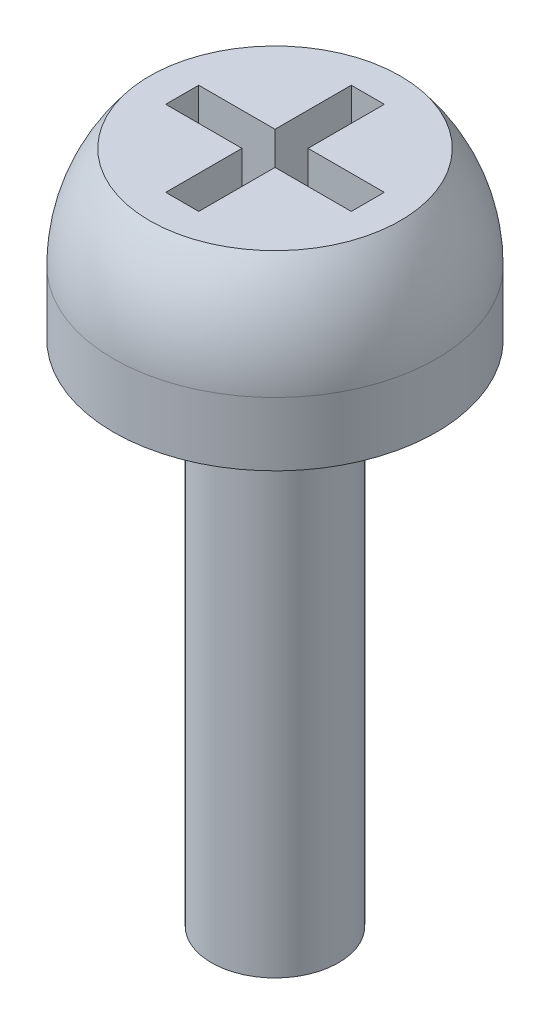
ISO-10303-21;
HEADER;
FILE_DESCRIPTION(('STEP AP214'),'2;1');
FILE_NAME('part.step','',(''),(''),'','','');
FILE_SCHEMA(('AUTOMOTIVE_DESIGN { 1 0 10303 214 1 1 1 1 }'));
ENDSEC;
DATA;
#1=APPLICATION_CONTEXT('core data for automotive mechanical design processes');
#2=APPLICATION_PROTOCOL_DEFINITION('international standard','automotive_design',2000,#1);
#3=PRODUCT_CONTEXT('',#1,'mechanical');
#4=PRODUCT('Part','Part','',(#3));
#5=PRODUCT_RELATED_PRODUCT_CATEGORY('part','',(#4));
#6=PRODUCT_DEFINITION_FORMATION('','',#4);
#7=PRODUCT_DEFINITION_CONTEXT('part definition',#1,'design');
#8=PRODUCT_DEFINITION('design','',#6,#7);
#9=PRODUCT_DEFINITION_SHAPE('','',#8);
#10=(LENGTH_UNIT() NAMED_UNIT(*) SI_UNIT(.MILLI.,.METRE.));
#11=(NAMED_UNIT(*) PLANE_ANGLE_UNIT() SI_UNIT($,.RADIAN.));
#12=(NAMED_UNIT(*) SI_UNIT($,.STERADIAN.) SOLID_ANGLE_UNIT());
#13=UNCERTAINTY_MEASURE_WITH_UNIT(LENGTH_MEASURE(1.E-05),#10,'distance_accuracy_value','');
#14=(GEOMETRIC_REPRESENTATION_CONTEXT(3) GLOBAL_UNCERTAINTY_ASSIGNED_CONTEXT((#13)) GLOBAL_UNIT_ASSIGNED_CONTEXT((#10,
#11,#12)) REPRESENTATION_CONTEXT('',''));
#15=CARTESIAN_POINT('',(0.,0.,0.));
#16=DIRECTION('',(0.,0.,1.));
#17=DIRECTION('',(1.,0.,0.));
#18=AXIS2_PLACEMENT_3D('',#15,#16,#17);
#19=CARTESIAN_POINT('',(0.,1.3,0.));
#20=DIRECTION('',(0.,-1.,0.));
#21=DIRECTION('',(0.,0.,-1.));
#22=AXIS2_PLACEMENT_3D('',#19,#20,#21);
#23=PLANE('',#22);
#24=CARTESIAN_POINT('',(0.,1.3,0.));
#25=DIRECTION('',(0.,-1.,0.));
#26=DIRECTION('',(0.,0.,-1.));
#27=AXIS2_PLACEMENT_3D('',#24,#25,#26);
#28=CIRCLE('',#27,0.986356933366416);
#29=CARTESIAN_POINT('',(0.,1.3,-0.986356933366416));
#30=VERTEX_POINT('',#29);
#31=EDGE_CURVE('E40',#30,#30,#28,.T.);
#32=ORIENTED_EDGE('',*,*,#31,.F.);
#33=EDGE_LOOP('',(#32));
#34=FACE_BOUND('',#33,.T.);
#35=DIRECTION('',(0.,0.,1.));
#36=VECTOR('',#35,1.);
#37=CARTESIAN_POINT('',(0.13,1.3,-0.13));
#38=LINE('',#37,#36);
#39=CARTESIAN_POINT('',(0.13,1.3,-0.73));
#40=VERTEX_POINT('',#39);
#41=CARTESIAN_POINT('',(0.13,1.3,-0.13));
#42=VERTEX_POINT('',#41);
#43=EDGE_CURVE('E53',#40,#42,#38,.T.);
#44=ORIENTED_EDGE('',*,*,#43,.T.);
#45=DIRECTION('',(1.,0.,0.));
#46=VECTOR('',#45,1.);
#47=CARTESIAN_POINT('',(0.13,1.3,-0.13));
#48=LINE('',#47,#46);
#49=CARTESIAN_POINT('',(0.73,1.3,-0.13));
#50=VERTEX_POINT('',#49);
#51=EDGE_CURVE('E161',#42,#50,#48,.T.);
#52=ORIENTED_EDGE('',*,*,#51,.T.);
#53=DIRECTION('',(0.,0.,1.));
#54=VECTOR('',#53,1.);
#55=CARTESIAN_POINT('',(0.73,1.3,-0.13));
#56=LINE('',#55,#54);
#57=CARTESIAN_POINT('',(0.73,1.3,0.13));
#58=VERTEX_POINT('',#57);
#59=EDGE_CURVE('E165',#50,#58,#56,.T.);
#60=ORIENTED_EDGE('',*,*,#59,.T.);
#61=DIRECTION('',(-1.,0.,0.));
#62=VECTOR('',#61,1.);
#63=CARTESIAN_POINT('',(0.13,1.3,0.13));
#64=LINE('',#63,#62);
#65=CARTESIAN_POINT('',(0.13,1.3,0.13));
#66=VERTEX_POINT('',#65);
#67=EDGE_CURVE('E168',#58,#66,#64,.T.);
#68=ORIENTED_EDGE('',*,*,#67,.T.);
#69=DIRECTION('',(0.,0.,1.));
#70=VECTOR('',#69,1.);
#71=CARTESIAN_POINT('',(0.13,1.3,0.73));
#72=LINE('',#71,#70);
#73=CARTESIAN_POINT('',(0.13,1.3,0.73));
#74=VERTEX_POINT('',#73);
#75=EDGE_CURVE('E171',#66,#74,#72,.T.);
#76=ORIENTED_EDGE('',*,*,#75,.T.);
#77=DIRECTION('',(-1.,0.,0.));
#78=VECTOR('',#77,1.);
#79=CARTESIAN_POINT('',(-0.13,1.3,0.73));
#80=LINE('',#79,#78);
#81=CARTESIAN_POINT('',(-0.13,1.3,0.73));
#82=VERTEX_POINT('',#81);
#83=EDGE_CURVE('E174',#74,#82,#80,.T.);
#84=ORIENTED_EDGE('',*,*,#83,.T.);
#85=DIRECTION('',(0.,0.,-1.));
#86=VECTOR('',#85,1.);
#87=CARTESIAN_POINT('',(-0.13,1.3,0.73));
#88=LINE('',#87,#86);
#89=CARTESIAN_POINT('',(-0.13,1.3,0.13));
#90=VERTEX_POINT('',#89);
#91=EDGE_CURVE('E177',#82,#90,#88,.T.);
#92=ORIENTED_EDGE('',*,*,#91,.T.);
#93=DIRECTION('',(-1.,0.,0.));
#94=VECTOR('',#93,1.);
#95=CARTESIAN_POINT('',(-0.73,1.3,0.13));
#96=LINE('',#95,#94);
#97=CARTESIAN_POINT('',(-0.73,1.3,0.13));
#98=VERTEX_POINT('',#97);
#99=EDGE_CURVE('E180',#90,#98,#96,.T.);
#100=ORIENTED_EDGE('',*,*,#99,.T.);
#101=DIRECTION('',(0.,0.,-1.));
#102=VECTOR('',#101,1.);
#103=CARTESIAN_POINT('',(-0.73,1.3,-0.13));
#104=LINE('',#103,#102);
#105=CARTESIAN_POINT('',(-0.73,1.3,-0.13));
#106=VERTEX_POINT('',#105);
#107=EDGE_CURVE('E183',#98,#106,#104,.T.);
#108=ORIENTED_EDGE('',*,*,#107,.T.);
#109=DIRECTION('',(1.,0.,0.));
#110=VECTOR('',#109,1.);
#111=CARTESIAN_POINT('',(-0.73,1.3,-0.13));
#112=LINE('',#111,#110);
#113=CARTESIAN_POINT('',(-0.13,1.3,-0.13));
#114=VERTEX_POINT('',#113);
#115=EDGE_CURVE('E186',#106,#114,#112,.T.);
#116=ORIENTED_EDGE('',*,*,#115,.T.);
#117=DIRECTION('',(0.,0.,-1.));
#118=VECTOR('',#117,1.);
#119=CARTESIAN_POINT('',(-0.13,1.3,-0.13));
#120=LINE('',#119,#118);
#121=CARTESIAN_POINT('',(-0.13,1.3,-0.73));
#122=VERTEX_POINT('',#121);
#123=EDGE_CURVE('E151',#114,#122,#120,.T.);
#124=ORIENTED_EDGE('',*,*,#123,.T.);
#125=DIRECTION('',(1.,0.,0.));
#126=VECTOR('',#125,1.);
#127=CARTESIAN_POINT('',(-0.13,1.3,-0.73));
#128=LINE('',#127,#126);
#129=EDGE_CURVE('E189',#122,#40,#128,.T.);
#130=ORIENTED_EDGE('',*,*,#129,.T.);
#131=EDGE_LOOP('',(#44,#52,#60,#68,#76,#84,#92,#100,#108,#116,#124,#130));
#132=FACE_BOUND('',#131,.T.);
#133=ADVANCED_FACE('F36',(#34,#132),#23,.F.);
#134=CARTESIAN_POINT('',(0.,0.5,0.));
#135=DIRECTION('',(0.,-1.,0.));
#136=DIRECTION('',(0.,0.,-1.));
#137=AXIS2_PLACEMENT_3D('',#134,#135,#136);
#138=CYLINDRICAL_SURFACE('',#137,1.27);
#139=CARTESIAN_POINT('',(0.,0.5,0.));
#140=DIRECTION('',(0.,1.,0.));
#141=DIRECTION('',(0.,0.,1.));
#142=AXIS2_PLACEMENT_3D('',#139,#140,#141);
#143=CIRCLE('',#142,1.27);
#144=CARTESIAN_POINT('',(0.,0.5,1.27));
#145=VERTEX_POINT('',#144);
#146=EDGE_CURVE('E45',#145,#145,#143,.T.);
#147=ORIENTED_EDGE('',*,*,#146,.F.);
#148=EDGE_LOOP('',(#147));
#149=FACE_BOUND('',#148,.T.);
#150=CARTESIAN_POINT('',(0.,0.,0.));
#151=DIRECTION('',(0.,1.,0.));
#152=DIRECTION('',(0.,0.,1.));
#153=AXIS2_PLACEMENT_3D('',#150,#151,#152);
#154=CIRCLE('',#153,1.27);
#155=CARTESIAN_POINT('',(0.,0.,1.27));
#156=VERTEX_POINT('',#155);
#157=EDGE_CURVE('E213',#156,#156,#154,.T.);
#158=ORIENTED_EDGE('',*,*,#157,.T.);
#159=EDGE_LOOP('',(#158));
#160=FACE_BOUND('',#159,.T.);
#161=ADVANCED_FACE('F38',(#149,#160),#138,.T.);
#162=CARTESIAN_POINT('',(0.,0.,0.));
#163=DIRECTION('',(0.,1.,0.));
#164=DIRECTION('',(0.,0.,1.));
#165=AXIS2_PLACEMENT_3D('',#162,#163,#164);
#166=PLANE('',#165);
#167=CARTESIAN_POINT('',(0.,0.,0.));
#168=DIRECTION('',(0.,-1.,0.));
#169=DIRECTION('',(0.,0.,-1.));
#170=AXIS2_PLACEMENT_3D('',#167,#168,#169);
#171=CIRCLE('',#170,0.5);
#172=CARTESIAN_POINT('',(0.,0.,-0.5));
#173=VERTEX_POINT('',#172);
#174=EDGE_CURVE('E11',#173,#173,#171,.T.);
#175=ORIENTED_EDGE('',*,*,#174,.F.);
#176=EDGE_LOOP('',(#175));
#177=FACE_BOUND('',#176,.T.);
#178=ORIENTED_EDGE('',*,*,#157,.F.);
#179=EDGE_LOOP('',(#178));
#180=FACE_BOUND('',#179,.T.);
#181=ADVANCED_FACE('F290',(#177,#180),#166,.F.);
#182=CARTESIAN_POINT('',(0.,0.5,0.));
#183=DIRECTION('',(0.,0.,1.));
#184=DIRECTION('',(1.,0.,0.));
#185=AXIS2_PLACEMENT_3D('',#182,#183,#184);
#186=SPHERICAL_SURFACE('',#185,1.27);
#187=CARTESIAN_POINT('',(0.,0.5,0.));
#188=DIRECTION('',(0.,-1.,0.));
#189=DIRECTION('',(0.,0.,-1.));
#190=AXIS2_PLACEMENT_3D('',#187,#188,#189);
#191=SPHERICAL_SURFACE('',#190,1.27);
#192=ORIENTED_EDGE('',*,*,#31,.T.);
#193=EDGE_LOOP('',(#192));
#194=FACE_BOUND('',#193,.T.);
#195=ORIENTED_EDGE('',*,*,#146,.T.);
#196=EDGE_LOOP('',(#195));
#197=FACE_BOUND('',#196,.T.);
#198=ADVANCED_FACE('F220',(#194,#197),#191,.T.);
#199=CARTESIAN_POINT('',(0.13,0.284,-0.13));
#200=DIRECTION('',(-1.,0.,0.));
#201=DIRECTION('',(0.,0.,1.));
#202=AXIS2_PLACEMENT_3D('',#199,#200,#201);
#203=PLANE('',#202);
#204=ORIENTED_EDGE('',*,*,#43,.F.);
#205=DIRECTION('',(0.,1.,0.));
#206=VECTOR('',#205,1.);
#207=CARTESIAN_POINT('',(0.13,0.284,-0.73));
#208=LINE('',#207,#206);
#209=CARTESIAN_POINT('',(0.13,0.284,-0.73));
#210=VERTEX_POINT('',#209);
#211=EDGE_CURVE('E156',#210,#40,#208,.T.);
#212=ORIENTED_EDGE('',*,*,#211,.F.);
#213=DIRECTION('',(0.,0.,1.));
#214=VECTOR('',#213,1.);
#215=CARTESIAN_POINT('',(0.13,0.284,-0.13));
#216=LINE('',#215,#214);
#217=CARTESIAN_POINT('',(0.13,0.284,-0.13));
#218=VERTEX_POINT('',#217);
#219=EDGE_CURVE('E192',#210,#218,#216,.T.);
#220=ORIENTED_EDGE('',*,*,#219,.T.);
#221=DIRECTION('',(0.,1.,0.));
#222=VECTOR('',#221,1.);
#223=CARTESIAN_POINT('',(0.13,0.284,-0.13));
#224=LINE('',#223,#222);
#225=EDGE_CURVE('E210',#218,#42,#224,.T.);
#226=ORIENTED_EDGE('',*,*,#225,.T.);
#227=EDGE_LOOP('',(#204,#212,#220,#226));
#228=FACE_BOUND('',#227,.T.);
#229=ADVANCED_FACE('F227',(#228),#203,.T.);
#230=CARTESIAN_POINT('',(0.13,0.284,-0.13));
#231=DIRECTION('',(0.,0.,1.));
#232=DIRECTION('',(1.,0.,0.));
#233=AXIS2_PLACEMENT_3D('',#230,#231,#232);
#234=PLANE('',#233);
#235=ORIENTED_EDGE('',*,*,#51,.F.);
#236=ORIENTED_EDGE('',*,*,#225,.F.);
#237=DIRECTION('',(1.,0.,0.));
#238=VECTOR('',#237,1.);
#239=CARTESIAN_POINT('',(0.13,0.284,-0.13));
#240=LINE('',#239,#238);
#241=CARTESIAN_POINT('',(0.73,0.284,-0.13));
#242=VERTEX_POINT('',#241);
#243=EDGE_CURVE('E110',#218,#242,#240,.T.);
#244=ORIENTED_EDGE('',*,*,#243,.T.);
#245=DIRECTION('',(0.,1.,0.));
#246=VECTOR('',#245,1.);
#247=CARTESIAN_POINT('',(0.73,0.284,-0.13));
#248=LINE('',#247,#246);
#249=EDGE_CURVE('E208',#242,#50,#248,.T.);
#250=ORIENTED_EDGE('',*,*,#249,.T.);
#251=EDGE_LOOP('',(#235,#236,#244,#250));
#252=FACE_BOUND('',#251,.T.);
#253=ADVANCED_FACE('F278',(#252),#234,.T.);
#254=CARTESIAN_POINT('',(0.73,0.284,-0.13));
#255=DIRECTION('',(-1.,0.,0.));
#256=DIRECTION('',(0.,0.,1.));
#257=AXIS2_PLACEMENT_3D('',#254,#255,#256);
#258=PLANE('',#257);
#259=ORIENTED_EDGE('',*,*,#59,.F.);
#260=ORIENTED_EDGE('',*,*,#249,.F.);
#261=DIRECTION('',(0.,0.,1.));
#262=VECTOR('',#261,1.);
#263=CARTESIAN_POINT('',(0.73,0.284,-0.13));
#264=LINE('',#263,#262);
#265=CARTESIAN_POINT('',(0.73,0.284,0.13));
#266=VERTEX_POINT('',#265);
#267=EDGE_CURVE('E230',#242,#266,#264,.T.);
#268=ORIENTED_EDGE('',*,*,#267,.T.);
#269=DIRECTION('',(0.,1.,0.));
#270=VECTOR('',#269,1.);
#271=CARTESIAN_POINT('',(0.73,0.284,0.13));
#272=LINE('',#271,#270);
#273=EDGE_CURVE('E206',#266,#58,#272,.T.);
#274=ORIENTED_EDGE('',*,*,#273,.T.);
#275=EDGE_LOOP('',(#259,#260,#268,#274));
#276=FACE_BOUND('',#275,.T.);
#277=ADVANCED_FACE('F275',(#276),#258,.T.);
#278=CARTESIAN_POINT('',(0.13,0.284,0.13));
#279=DIRECTION('',(0.,0.,-1.));
#280=DIRECTION('',(-1.,0.,0.));
#281=AXIS2_PLACEMENT_3D('',#278,#279,#280);
#282=PLANE('',#281);
#283=ORIENTED_EDGE('',*,*,#67,.F.);
#284=ORIENTED_EDGE('',*,*,#273,.F.);
#285=DIRECTION('',(-1.,0.,0.));
#286=VECTOR('',#285,1.);
#287=CARTESIAN_POINT('',(0.13,0.284,0.13));
#288=LINE('',#287,#286);
#289=CARTESIAN_POINT('',(0.13,0.284,0.13));
#290=VERTEX_POINT('',#289);
#291=EDGE_CURVE('E235',#266,#290,#288,.T.);
#292=ORIENTED_EDGE('',*,*,#291,.T.);
#293=DIRECTION('',(0.,1.,0.));
#294=VECTOR('',#293,1.);
#295=CARTESIAN_POINT('',(0.13,0.284,0.13));
#296=LINE('',#295,#294);
#297=EDGE_CURVE('E204',#290,#66,#296,.T.);
#298=ORIENTED_EDGE('',*,*,#297,.T.);
#299=EDGE_LOOP('',(#283,#284,#292,#298));
#300=FACE_BOUND('',#299,.T.);
#301=ADVANCED_FACE('F271',(#300),#282,.T.);
#302=CARTESIAN_POINT('',(0.13,0.284,0.73));
#303=DIRECTION('',(-1.,0.,0.));
#304=DIRECTION('',(0.,0.,1.));
#305=AXIS2_PLACEMENT_3D('',#302,#303,#304);
#306=PLANE('',#305);
#307=ORIENTED_EDGE('',*,*,#75,.F.);
#308=ORIENTED_EDGE('',*,*,#297,.F.);
#309=DIRECTION('',(0.,0.,1.));
#310=VECTOR('',#309,1.);
#311=CARTESIAN_POINT('',(0.13,0.284,0.73));
#312=LINE('',#311,#310);
#313=CARTESIAN_POINT('',(0.13,0.284,0.73));
#314=VERTEX_POINT('',#313);
#315=EDGE_CURVE('E237',#290,#314,#312,.T.);
#316=ORIENTED_EDGE('',*,*,#315,.T.);
#317=DIRECTION('',(0.,1.,0.));
#318=VECTOR('',#317,1.);
#319=CARTESIAN_POINT('',(0.13,0.284,0.73));
#320=LINE('',#319,#318);
#321=EDGE_CURVE('E202',#314,#74,#320,.T.);
#322=ORIENTED_EDGE('',*,*,#321,.T.);
#323=EDGE_LOOP('',(#307,#308,#316,#322));
#324=FACE_BOUND('',#323,.T.);
#325=ADVANCED_FACE('F268',(#324),#306,.T.);
#326=CARTESIAN_POINT('',(-0.13,0.284,0.73));
#327=DIRECTION('',(0.,0.,-1.));
#328=DIRECTION('',(-1.,0.,0.));
#329=AXIS2_PLACEMENT_3D('',#326,#327,#328);
#330=PLANE('',#329);
#331=ORIENTED_EDGE('',*,*,#83,.F.);
#332=ORIENTED_EDGE('',*,*,#321,.F.);
#333=DIRECTION('',(-1.,0.,0.));
#334=VECTOR('',#333,1.);
#335=CARTESIAN_POINT('',(-0.13,0.284,0.73));
#336=LINE('',#335,#334);
#337=CARTESIAN_POINT('',(-0.13,0.284,0.73));
#338=VERTEX_POINT('',#337);
#339=EDGE_CURVE('E239',#314,#338,#336,.T.);
#340=ORIENTED_EDGE('',*,*,#339,.T.);
#341=DIRECTION('',(0.,1.,0.));
#342=VECTOR('',#341,1.);
#343=CARTESIAN_POINT('',(-0.13,0.284,0.73));
#344=LINE('',#343,#342);
#345=EDGE_CURVE('E200',#338,#82,#344,.T.);
#346=ORIENTED_EDGE('',*,*,#345,.T.);
#347=EDGE_LOOP('',(#331,#332,#340,#346));
#348=FACE_BOUND('',#347,.T.);
#349=ADVANCED_FACE('F261',(#348),#330,.T.);
#350=CARTESIAN_POINT('',(-0.13,0.284,0.73));
#351=DIRECTION('',(1.,0.,0.));
#352=DIRECTION('',(0.,0.,-1.));
#353=AXIS2_PLACEMENT_3D('',#350,#351,#352);
#354=PLANE('',#353);
#355=ORIENTED_EDGE('',*,*,#91,.F.);
#356=ORIENTED_EDGE('',*,*,#345,.F.);
#357=DIRECTION('',(0.,0.,-1.));
#358=VECTOR('',#357,1.);
#359=CARTESIAN_POINT('',(-0.13,0.284,0.73));
#360=LINE('',#359,#358);
#361=CARTESIAN_POINT('',(-0.13,0.284,0.13));
#362=VERTEX_POINT('',#361);
#363=EDGE_CURVE('E241',#338,#362,#360,.T.);
#364=ORIENTED_EDGE('',*,*,#363,.T.);
#365=DIRECTION('',(0.,1.,0.));
#366=VECTOR('',#365,1.);
#367=CARTESIAN_POINT('',(-0.13,0.284,0.13));
#368=LINE('',#367,#366);
#369=EDGE_CURVE('E198',#362,#90,#368,.T.);
#370=ORIENTED_EDGE('',*,*,#369,.T.);
#371=EDGE_LOOP('',(#355,#356,#364,#370));
#372=FACE_BOUND('',#371,.T.);
#373=ADVANCED_FACE('F257',(#372),#354,.T.);
#374=CARTESIAN_POINT('',(-0.73,0.284,0.13));
#375=DIRECTION('',(0.,0.,-1.));
#376=DIRECTION('',(-1.,0.,0.));
#377=AXIS2_PLACEMENT_3D('',#374,#375,#376);
#378=PLANE('',#377);
#379=ORIENTED_EDGE('',*,*,#99,.F.);
#380=ORIENTED_EDGE('',*,*,#369,.F.);
#381=DIRECTION('',(-1.,0.,0.));
#382=VECTOR('',#381,1.);
#383=CARTESIAN_POINT('',(-0.73,0.284,0.13));
#384=LINE('',#383,#382);
#385=CARTESIAN_POINT('',(-0.73,0.284,0.13));
#386=VERTEX_POINT('',#385);
#387=EDGE_CURVE('E243',#362,#386,#384,.T.);
#388=ORIENTED_EDGE('',*,*,#387,.T.);
#389=DIRECTION('',(0.,1.,0.));
#390=VECTOR('',#389,1.);
#391=CARTESIAN_POINT('',(-0.73,0.284,0.13));
#392=LINE('',#391,#390);
#393=EDGE_CURVE('E196',#386,#98,#392,.T.);
#394=ORIENTED_EDGE('',*,*,#393,.T.);
#395=EDGE_LOOP('',(#379,#380,#388,#394));
#396=FACE_BOUND('',#395,.T.);
#397=ADVANCED_FACE('F254',(#396),#378,.T.);
#398=CARTESIAN_POINT('',(-0.73,0.284,-0.13));
#399=DIRECTION('',(1.,0.,0.));
#400=DIRECTION('',(0.,0.,-1.));
#401=AXIS2_PLACEMENT_3D('',#398,#399,#400);
#402=PLANE('',#401);
#403=ORIENTED_EDGE('',*,*,#107,.F.);
#404=ORIENTED_EDGE('',*,*,#393,.F.);
#405=DIRECTION('',(0.,0.,-1.));
#406=VECTOR('',#405,1.);
#407=CARTESIAN_POINT('',(-0.73,0.284,-0.13));
#408=LINE('',#407,#406);
#409=CARTESIAN_POINT('',(-0.73,0.284,-0.13));
#410=VERTEX_POINT('',#409);
#411=EDGE_CURVE('E147',#386,#410,#408,.T.);
#412=ORIENTED_EDGE('',*,*,#411,.T.);
#413=DIRECTION('',(0.,1.,0.));
#414=VECTOR('',#413,1.);
#415=CARTESIAN_POINT('',(-0.73,0.284,-0.13));
#416=LINE('',#415,#414);
#417=EDGE_CURVE('E143',#410,#106,#416,.T.);
#418=ORIENTED_EDGE('',*,*,#417,.T.);
#419=EDGE_LOOP('',(#403,#404,#412,#418));
#420=FACE_BOUND('',#419,.T.);
#421=ADVANCED_FACE('F247',(#420),#402,.T.);
#422=CARTESIAN_POINT('',(-0.73,0.284,-0.13));
#423=DIRECTION('',(0.,0.,1.));
#424=DIRECTION('',(1.,0.,0.));
#425=AXIS2_PLACEMENT_3D('',#422,#423,#424);
#426=PLANE('',#425);
#427=ORIENTED_EDGE('',*,*,#115,.F.);
#428=ORIENTED_EDGE('',*,*,#417,.F.);
#429=DIRECTION('',(1.,0.,0.));
#430=VECTOR('',#429,1.);
#431=CARTESIAN_POINT('',(-0.73,0.284,-0.13));
#432=LINE('',#431,#430);
#433=CARTESIAN_POINT('',(-0.13,0.284,-0.13));
#434=VERTEX_POINT('',#433);
#435=EDGE_CURVE('E138',#410,#434,#432,.T.);
#436=ORIENTED_EDGE('',*,*,#435,.T.);
#437=DIRECTION('',(0.,1.,0.));
#438=VECTOR('',#437,1.);
#439=CARTESIAN_POINT('',(-0.13,0.284,-0.13));
#440=LINE('',#439,#438);
#441=EDGE_CURVE('E142',#434,#114,#440,.T.);
#442=ORIENTED_EDGE('',*,*,#441,.T.);
#443=EDGE_LOOP('',(#427,#428,#436,#442));
#444=FACE_BOUND('',#443,.T.);
#445=ADVANCED_FACE('F141',(#444),#426,.T.);
#446=CARTESIAN_POINT('',(-0.13,0.284,-0.13));
#447=DIRECTION('',(1.,0.,0.));
#448=DIRECTION('',(0.,0.,-1.));
#449=AXIS2_PLACEMENT_3D('',#446,#447,#448);
#450=PLANE('',#449);
#451=ORIENTED_EDGE('',*,*,#123,.F.);
#452=ORIENTED_EDGE('',*,*,#441,.F.);
#453=DIRECTION('',(0.,0.,-1.));
#454=VECTOR('',#453,1.);
#455=CARTESIAN_POINT('',(-0.13,0.284,-0.13));
#456=LINE('',#455,#454);
#457=CARTESIAN_POINT('',(-0.13,0.284,-0.73));
#458=VERTEX_POINT('',#457);
#459=EDGE_CURVE('E146',#434,#458,#456,.T.);
#460=ORIENTED_EDGE('',*,*,#459,.T.);
#461=DIRECTION('',(0.,1.,0.));
#462=VECTOR('',#461,1.);
#463=CARTESIAN_POINT('',(-0.13,0.284,-0.73));
#464=LINE('',#463,#462);
#465=EDGE_CURVE('E101',#458,#122,#464,.T.);
#466=ORIENTED_EDGE('',*,*,#465,.T.);
#467=EDGE_LOOP('',(#451,#452,#460,#466));
#468=FACE_BOUND('',#467,.T.);
#469=ADVANCED_FACE('F149',(#468),#450,.T.);
#470=CARTESIAN_POINT('',(-0.13,0.284,-0.73));
#471=DIRECTION('',(0.,0.,1.));
#472=DIRECTION('',(1.,0.,0.));
#473=AXIS2_PLACEMENT_3D('',#470,#471,#472);
#474=PLANE('',#473);
#475=ORIENTED_EDGE('',*,*,#129,.F.);
#476=ORIENTED_EDGE('',*,*,#465,.F.);
#477=DIRECTION('',(1.,0.,0.));
#478=VECTOR('',#477,1.);
#479=CARTESIAN_POINT('',(-0.13,0.284,-0.73));
#480=LINE('',#479,#478);
#481=EDGE_CURVE('E61',#458,#210,#480,.T.);
#482=ORIENTED_EDGE('',*,*,#481,.T.);
#483=ORIENTED_EDGE('',*,*,#211,.T.);
#484=EDGE_LOOP('',(#475,#476,#482,#483));
#485=FACE_BOUND('',#484,.T.);
#486=ADVANCED_FACE('F226',(#485),#474,.T.);
#487=CARTESIAN_POINT('',(0.,0.284,0.));
#488=DIRECTION('',(0.,-1.,0.));
#489=DIRECTION('',(0.,0.,-1.));
#490=AXIS2_PLACEMENT_3D('',#487,#488,#489);
#491=PLANE('',#490);
#492=ORIENTED_EDGE('',*,*,#219,.F.);
#493=ORIENTED_EDGE('',*,*,#481,.F.);
#494=ORIENTED_EDGE('',*,*,#459,.F.);
#495=ORIENTED_EDGE('',*,*,#435,.F.);
#496=ORIENTED_EDGE('',*,*,#411,.F.);
#497=ORIENTED_EDGE('',*,*,#387,.F.);
#498=ORIENTED_EDGE('',*,*,#363,.F.);
#499=ORIENTED_EDGE('',*,*,#339,.F.);
#500=ORIENTED_EDGE('',*,*,#315,.F.);
#501=ORIENTED_EDGE('',*,*,#291,.F.);
#502=ORIENTED_EDGE('',*,*,#267,.F.);
#503=ORIENTED_EDGE('',*,*,#243,.F.);
#504=EDGE_LOOP('',(#492,#493,#494,#495,#496,#497,#498,#499,#500,#501,#502,#503));
#505=FACE_BOUND('',#504,.T.);
#506=ADVANCED_FACE('F154',(#505),#491,.F.);
#507=CARTESIAN_POINT('',(0.,-4.,0.));
#508=DIRECTION('',(0.,1.,0.));
#509=DIRECTION('',(0.,0.,1.));
#510=AXIS2_PLACEMENT_3D('',#507,#508,#509);
#511=CYLINDRICAL_SURFACE('',#510,0.5);
#512=CARTESIAN_POINT('',(0.,-4.,0.));
#513=DIRECTION('',(0.,-1.,0.));
#514=DIRECTION('',(0.,0.,-1.));
#515=AXIS2_PLACEMENT_3D('',#512,#513,#514);
#516=CIRCLE('',#515,0.5);
#517=CARTESIAN_POINT('',(0.,-4.,-0.5));
#518=VERTEX_POINT('',#517);
#519=EDGE_CURVE('E162',#518,#518,#516,.T.);
#520=ORIENTED_EDGE('',*,*,#519,.F.);
#521=EDGE_LOOP('',(#520));
#522=FACE_BOUND('',#521,.T.);
#523=ORIENTED_EDGE('',*,*,#174,.T.);
#524=EDGE_LOOP('',(#523));
#525=FACE_BOUND('',#524,.T.);
#526=ADVANCED_FACE('F300',(#522,#525),#511,.T.);
#527=CARTESIAN_POINT('',(0.,-4.,0.));
#528=DIRECTION('',(0.,-1.,0.));
#529=DIRECTION('',(0.,0.,-1.));
#530=AXIS2_PLACEMENT_3D('',#527,#528,#529);
#531=PLANE('',#530);
#532=ORIENTED_EDGE('',*,*,#519,.T.);
#533=EDGE_LOOP('',(#532));
#534=FACE_BOUND('',#533,.T.);
#535=ADVANCED_FACE('F302',(#534),#531,.T.);
#536=CLOSED_SHELL('',(#133,#161,#181,#198,#229,#253,#277,#301,#325,#349,#373,#397,#421,#445,
#469,#486,#506,#526,#535));
#537=MANIFOLD_SOLID_BREP('B2',#536);
#538=ADVANCED_BREP_SHAPE_REPRESENTATION('',(#18,#537),#14);
#539=SHAPE_DEFINITION_REPRESENTATION(#9,#538);
ENDSEC;
END-ISO-10303-21;
